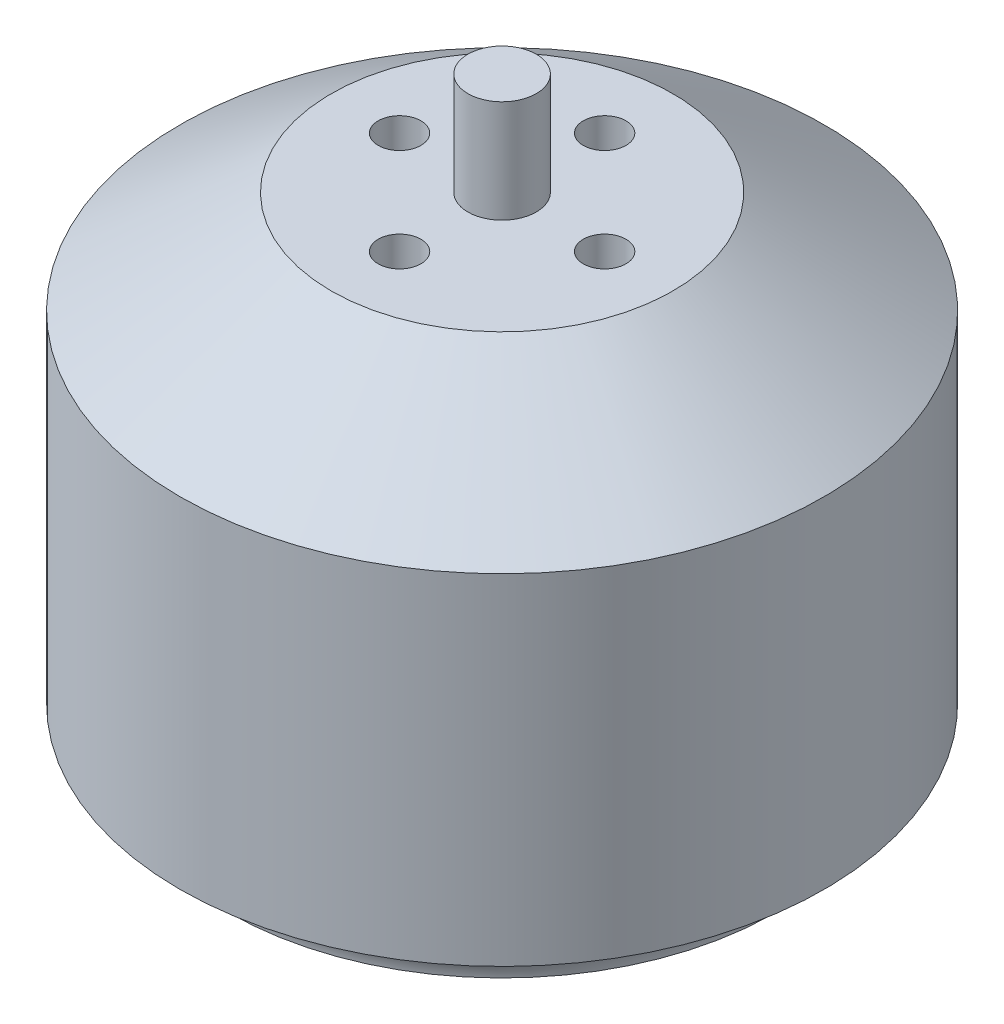
ISO-10303-21;
HEADER;
FILE_DESCRIPTION(('STEP AP214'),'2;1');
FILE_NAME('part.step','',(''),(''),'','','');
FILE_SCHEMA(('AUTOMOTIVE_DESIGN { 1 0 10303 214 1 1 1 1 }'));
ENDSEC;
DATA;
#1=APPLICATION_CONTEXT('core data for automotive mechanical design processes');
#2=APPLICATION_PROTOCOL_DEFINITION('international standard','automotive_design',2000,#1);
#3=PRODUCT_CONTEXT('',#1,'mechanical');
#4=PRODUCT('Part','Part','',(#3));
#5=PRODUCT_RELATED_PRODUCT_CATEGORY('part','',(#4));
#6=PRODUCT_DEFINITION_FORMATION('','',#4);
#7=PRODUCT_DEFINITION_CONTEXT('part definition',#1,'design');
#8=PRODUCT_DEFINITION('design','',#6,#7);
#9=PRODUCT_DEFINITION_SHAPE('','',#8);
#10=(LENGTH_UNIT() NAMED_UNIT(*) SI_UNIT(.MILLI.,.METRE.));
#11=(NAMED_UNIT(*) PLANE_ANGLE_UNIT() SI_UNIT($,.RADIAN.));
#12=(NAMED_UNIT(*) SI_UNIT($,.STERADIAN.) SOLID_ANGLE_UNIT());
#13=UNCERTAINTY_MEASURE_WITH_UNIT(LENGTH_MEASURE(1.E-05),#10,'distance_accuracy_value','');
#14=(GEOMETRIC_REPRESENTATION_CONTEXT(3) GLOBAL_UNCERTAINTY_ASSIGNED_CONTEXT((#13)) GLOBAL_UNIT_ASSIGNED_CONTEXT((#10,
#11,#12)) REPRESENTATION_CONTEXT('',''));
#15=CARTESIAN_POINT('',(0.,0.,0.));
#16=DIRECTION('',(0.,0.,1.));
#17=DIRECTION('',(1.,0.,0.));
#18=AXIS2_PLACEMENT_3D('',#15,#16,#17);
#19=CARTESIAN_POINT('',(0.,0.,0.));
#20=DIRECTION('',(0.,1.,0.));
#21=DIRECTION('',(0.,0.,1.));
#22=AXIS2_PLACEMENT_3D('',#19,#20,#21);
#23=PLANE('',#22);
#24=CARTESIAN_POINT('',(0.,0.,0.));
#25=DIRECTION('',(0.,1.,0.));
#26=DIRECTION('',(0.,0.,1.));
#27=AXIS2_PLACEMENT_3D('',#24,#25,#26);
#28=CIRCLE('',#27,16.);
#29=CARTESIAN_POINT('',(0.,0.,16.));
#30=VERTEX_POINT('',#29);
#31=EDGE_CURVE('E123',#30,#30,#28,.T.);
#32=ORIENTED_EDGE('',*,*,#31,.F.);
#33=EDGE_LOOP('',(#32));
#34=FACE_BOUND('',#33,.T.);
#35=CARTESIAN_POINT('',(0.,0.,9.5));
#36=DIRECTION('',(0.,-1.,0.));
#37=DIRECTION('',(0.,0.,-1.));
#38=AXIS2_PLACEMENT_3D('',#35,#36,#37);
#39=CIRCLE('',#38,1.24999999999999);
#40=CARTESIAN_POINT('',(0.,0.,8.25000000000001));
#41=VERTEX_POINT('',#40);
#42=EDGE_CURVE('E126',#41,#41,#39,.T.);
#43=ORIENTED_EDGE('',*,*,#42,.F.);
#44=EDGE_LOOP('',(#43));
#45=FACE_BOUND('',#44,.T.);
#46=CARTESIAN_POINT('',(12.5,0.,0.));
#47=DIRECTION('',(0.,-1.,0.));
#48=DIRECTION('',(0.,0.,-1.));
#49=AXIS2_PLACEMENT_3D('',#46,#47,#48);
#50=CIRCLE('',#49,1.24999999999999);
#51=CARTESIAN_POINT('',(12.5,0.,-1.24999999999999));
#52=VERTEX_POINT('',#51);
#53=EDGE_CURVE('E142',#52,#52,#50,.T.);
#54=ORIENTED_EDGE('',*,*,#53,.F.);
#55=EDGE_LOOP('',(#54));
#56=FACE_BOUND('',#55,.T.);
#57=CARTESIAN_POINT('',(0.,0.,-9.5));
#58=DIRECTION('',(0.,-1.,0.));
#59=DIRECTION('',(0.,0.,-1.));
#60=AXIS2_PLACEMENT_3D('',#57,#58,#59);
#61=CIRCLE('',#60,1.24999999999999);
#62=CARTESIAN_POINT('',(0.,0.,-10.75));
#63=VERTEX_POINT('',#62);
#64=EDGE_CURVE('E148',#63,#63,#61,.T.);
#65=ORIENTED_EDGE('',*,*,#64,.F.);
#66=EDGE_LOOP('',(#65));
#67=FACE_BOUND('',#66,.T.);
#68=CARTESIAN_POINT('',(-8.,0.,0.));
#69=DIRECTION('',(0.,-1.,0.));
#70=DIRECTION('',(0.,0.,-1.));
#71=AXIS2_PLACEMENT_3D('',#68,#69,#70);
#72=CIRCLE('',#71,1.24999999999999);
#73=CARTESIAN_POINT('',(-8.,0.,-1.24999999999999));
#74=VERTEX_POINT('',#73);
#75=EDGE_CURVE('E154',#74,#74,#72,.T.);
#76=ORIENTED_EDGE('',*,*,#75,.F.);
#77=EDGE_LOOP('',(#76));
#78=FACE_BOUND('',#77,.T.);
#79=CARTESIAN_POINT('',(-12.5,0.,0.));
#80=DIRECTION('',(0.,-1.,0.));
#81=DIRECTION('',(0.,0.,-1.));
#82=AXIS2_PLACEMENT_3D('',#79,#80,#81);
#83=CIRCLE('',#82,1.24999999999999);
#84=CARTESIAN_POINT('',(-12.5,0.,-1.24999999999999));
#85=VERTEX_POINT('',#84);
#86=EDGE_CURVE('E160',#85,#85,#83,.T.);
#87=ORIENTED_EDGE('',*,*,#86,.F.);
#88=EDGE_LOOP('',(#87));
#89=FACE_BOUND('',#88,.T.);
#90=CARTESIAN_POINT('',(0.,0.,0.));
#91=DIRECTION('',(0.,1.,0.));
#92=DIRECTION('',(0.,0.,1.));
#93=AXIS2_PLACEMENT_3D('',#90,#91,#92);
#94=CIRCLE('',#93,2.);
#95=CARTESIAN_POINT('',(0.,0.,2.));
#96=VERTEX_POINT('',#95);
#97=EDGE_CURVE('E11',#96,#96,#94,.F.);
#98=ORIENTED_EDGE('',*,*,#97,.F.);
#99=EDGE_LOOP('',(#98));
#100=FACE_BOUND('',#99,.T.);
#101=CARTESIAN_POINT('',(8.,0.,0.));
#102=DIRECTION('',(0.,-1.,0.));
#103=DIRECTION('',(0.,0.,-1.));
#104=AXIS2_PLACEMENT_3D('',#101,#102,#103);
#105=CIRCLE('',#104,1.24999999999999);
#106=CARTESIAN_POINT('',(8.,0.,-1.24999999999999));
#107=VERTEX_POINT('',#106);
#108=EDGE_CURVE('E136',#107,#107,#105,.T.);
#109=ORIENTED_EDGE('',*,*,#108,.F.);
#110=EDGE_LOOP('',(#109));
#111=FACE_BOUND('',#110,.T.);
#112=ADVANCED_FACE('F46',(#34,#45,#56,#67,#78,#89,#100,#111),#23,.F.);
#113=CARTESIAN_POINT('',(0.,-2.6,0.));
#114=DIRECTION('',(0.,1.,0.));
#115=DIRECTION('',(0.,0.,1.));
#116=AXIS2_PLACEMENT_3D('',#113,#114,#115);
#117=CYLINDRICAL_SURFACE('',#116,2.);
#118=CARTESIAN_POINT('',(0.,-2.6,0.));
#119=DIRECTION('',(0.,-1.,0.));
#120=DIRECTION('',(0.,0.,-1.));
#121=AXIS2_PLACEMENT_3D('',#118,#119,#120);
#122=CIRCLE('',#121,2.);
#123=CARTESIAN_POINT('',(0.,-2.6,-2.));
#124=VERTEX_POINT('',#123);
#125=EDGE_CURVE('E166',#124,#124,#122,.T.);
#126=ORIENTED_EDGE('',*,*,#125,.F.);
#127=EDGE_LOOP('',(#126));
#128=FACE_BOUND('',#127,.T.);
#129=ORIENTED_EDGE('',*,*,#97,.T.);
#130=EDGE_LOOP('',(#129));
#131=FACE_BOUND('',#130,.T.);
#132=ADVANCED_FACE('F204',(#128,#131),#117,.T.);
#133=CARTESIAN_POINT('',(0.,-2.6,0.));
#134=DIRECTION('',(0.,-1.,0.));
#135=DIRECTION('',(0.,0.,-1.));
#136=AXIS2_PLACEMENT_3D('',#133,#134,#135);
#137=PLANE('',#136);
#138=ORIENTED_EDGE('',*,*,#125,.T.);
#139=EDGE_LOOP('',(#138));
#140=FACE_BOUND('',#139,.T.);
#141=ADVANCED_FACE('F266',(#140),#137,.T.);
#142=CARTESIAN_POINT('',(-12.5,1.64892422621555,0.));
#143=DIRECTION('',(0.,-1.,0.));
#144=DIRECTION('',(0.,0.,-1.));
#145=AXIS2_PLACEMENT_3D('',#142,#143,#144);
#146=CONICAL_SURFACE('',#145,1.25,1.02974425867665);
#147=CARTESIAN_POINT('',(-12.5,2.4,0.));
#148=VERTEX_POINT('',#147);
#149=VERTEX_LOOP('',#148);
#150=FACE_BOUND('',#149,.T.);
#151=CARTESIAN_POINT('',(-12.5,1.64892422621555,0.));
#152=DIRECTION('',(0.,-1.,0.));
#153=DIRECTION('',(0.,0.,-1.));
#154=AXIS2_PLACEMENT_3D('',#151,#152,#153);
#155=CIRCLE('',#154,1.25);
#156=CARTESIAN_POINT('',(-12.5,1.64892422621555,-1.25));
#157=VERTEX_POINT('',#156);
#158=EDGE_CURVE('E163',#157,#157,#155,.T.);
#159=ORIENTED_EDGE('',*,*,#158,.T.);
#160=EDGE_LOOP('',(#159));
#161=FACE_BOUND('',#160,.T.);
#162=ADVANCED_FACE('F262',(#150,#161),#146,.F.);
#163=CARTESIAN_POINT('',(-12.5,0.,0.));
#164=DIRECTION('',(0.,-1.,0.));
#165=DIRECTION('',(0.,0.,-1.));
#166=AXIS2_PLACEMENT_3D('',#163,#164,#165);
#167=CYLINDRICAL_SURFACE('',#166,1.24999999999999);
#168=ORIENTED_EDGE('',*,*,#158,.F.);
#169=EDGE_LOOP('',(#168));
#170=FACE_BOUND('',#169,.T.);
#171=ORIENTED_EDGE('',*,*,#86,.T.);
#172=EDGE_LOOP('',(#171));
#173=FACE_BOUND('',#172,.T.);
#174=ADVANCED_FACE('F259',(#170,#173),#167,.F.);
#175=CARTESIAN_POINT('',(-8.,1.64892422621555,0.));
#176=DIRECTION('',(0.,-1.,0.));
#177=DIRECTION('',(0.,0.,-1.));
#178=AXIS2_PLACEMENT_3D('',#175,#176,#177);
#179=CONICAL_SURFACE('',#178,1.25,1.02974425867665);
#180=CARTESIAN_POINT('',(-8.,2.4,0.));
#181=VERTEX_POINT('',#180);
#182=VERTEX_LOOP('',#181);
#183=FACE_BOUND('',#182,.T.);
#184=CARTESIAN_POINT('',(-8.,1.64892422621555,0.));
#185=DIRECTION('',(0.,-1.,0.));
#186=DIRECTION('',(0.,0.,-1.));
#187=AXIS2_PLACEMENT_3D('',#184,#185,#186);
#188=CIRCLE('',#187,1.25);
#189=CARTESIAN_POINT('',(-8.,1.64892422621555,-1.25));
#190=VERTEX_POINT('',#189);
#191=EDGE_CURVE('E157',#190,#190,#188,.T.);
#192=ORIENTED_EDGE('',*,*,#191,.T.);
#193=EDGE_LOOP('',(#192));
#194=FACE_BOUND('',#193,.T.);
#195=ADVANCED_FACE('F255',(#183,#194),#179,.F.);
#196=CARTESIAN_POINT('',(-8.,0.,0.));
#197=DIRECTION('',(0.,-1.,0.));
#198=DIRECTION('',(0.,0.,-1.));
#199=AXIS2_PLACEMENT_3D('',#196,#197,#198);
#200=CYLINDRICAL_SURFACE('',#199,1.24999999999999);
#201=ORIENTED_EDGE('',*,*,#191,.F.);
#202=EDGE_LOOP('',(#201));
#203=FACE_BOUND('',#202,.T.);
#204=ORIENTED_EDGE('',*,*,#75,.T.);
#205=EDGE_LOOP('',(#204));
#206=FACE_BOUND('',#205,.T.);
#207=ADVANCED_FACE('F251',(#203,#206),#200,.F.);
#208=CARTESIAN_POINT('',(0.,1.64892422621555,-9.5));
#209=DIRECTION('',(0.,-1.,0.));
#210=DIRECTION('',(0.,0.,-1.));
#211=AXIS2_PLACEMENT_3D('',#208,#209,#210);
#212=CONICAL_SURFACE('',#211,1.25,1.02974425867665);
#213=CARTESIAN_POINT('',(0.,2.4,-9.5));
#214=VERTEX_POINT('',#213);
#215=VERTEX_LOOP('',#214);
#216=FACE_BOUND('',#215,.T.);
#217=CARTESIAN_POINT('',(0.,1.64892422621555,-9.5));
#218=DIRECTION('',(0.,-1.,0.));
#219=DIRECTION('',(0.,0.,-1.));
#220=AXIS2_PLACEMENT_3D('',#217,#218,#219);
#221=CIRCLE('',#220,1.25);
#222=CARTESIAN_POINT('',(0.,1.64892422621555,-10.75));
#223=VERTEX_POINT('',#222);
#224=EDGE_CURVE('E151',#223,#223,#221,.T.);
#225=ORIENTED_EDGE('',*,*,#224,.T.);
#226=EDGE_LOOP('',(#225));
#227=FACE_BOUND('',#226,.T.);
#228=ADVANCED_FACE('F247',(#216,#227),#212,.F.);
#229=CARTESIAN_POINT('',(0.,0.,-9.5));
#230=DIRECTION('',(0.,-1.,0.));
#231=DIRECTION('',(0.,0.,-1.));
#232=AXIS2_PLACEMENT_3D('',#229,#230,#231);
#233=CYLINDRICAL_SURFACE('',#232,1.24999999999999);
#234=ORIENTED_EDGE('',*,*,#224,.F.);
#235=EDGE_LOOP('',(#234));
#236=FACE_BOUND('',#235,.T.);
#237=ORIENTED_EDGE('',*,*,#64,.T.);
#238=EDGE_LOOP('',(#237));
#239=FACE_BOUND('',#238,.T.);
#240=ADVANCED_FACE('F243',(#236,#239),#233,.F.);
#241=CARTESIAN_POINT('',(12.5,1.64892422621555,0.));
#242=DIRECTION('',(0.,-1.,0.));
#243=DIRECTION('',(0.,0.,-1.));
#244=AXIS2_PLACEMENT_3D('',#241,#242,#243);
#245=CONICAL_SURFACE('',#244,1.25,1.02974425867665);
#246=CARTESIAN_POINT('',(12.5,2.4,0.));
#247=VERTEX_POINT('',#246);
#248=VERTEX_LOOP('',#247);
#249=FACE_BOUND('',#248,.T.);
#250=CARTESIAN_POINT('',(12.5,1.64892422621555,0.));
#251=DIRECTION('',(0.,-1.,0.));
#252=DIRECTION('',(0.,0.,-1.));
#253=AXIS2_PLACEMENT_3D('',#250,#251,#252);
#254=CIRCLE('',#253,1.25);
#255=CARTESIAN_POINT('',(12.5,1.64892422621555,-1.25));
#256=VERTEX_POINT('',#255);
#257=EDGE_CURVE('E145',#256,#256,#254,.T.);
#258=ORIENTED_EDGE('',*,*,#257,.T.);
#259=EDGE_LOOP('',(#258));
#260=FACE_BOUND('',#259,.T.);
#261=ADVANCED_FACE('F239',(#249,#260),#245,.F.);
#262=CARTESIAN_POINT('',(12.5,0.,0.));
#263=DIRECTION('',(0.,-1.,0.));
#264=DIRECTION('',(0.,0.,-1.));
#265=AXIS2_PLACEMENT_3D('',#262,#263,#264);
#266=CYLINDRICAL_SURFACE('',#265,1.24999999999999);
#267=ORIENTED_EDGE('',*,*,#257,.F.);
#268=EDGE_LOOP('',(#267));
#269=FACE_BOUND('',#268,.T.);
#270=ORIENTED_EDGE('',*,*,#53,.T.);
#271=EDGE_LOOP('',(#270));
#272=FACE_BOUND('',#271,.T.);
#273=ADVANCED_FACE('F231',(#269,#272),#266,.F.);
#274=CARTESIAN_POINT('',(8.,1.64892422621555,0.));
#275=DIRECTION('',(0.,-1.,0.));
#276=DIRECTION('',(0.,0.,-1.));
#277=AXIS2_PLACEMENT_3D('',#274,#275,#276);
#278=CONICAL_SURFACE('',#277,1.25,1.02974425867665);
#279=CARTESIAN_POINT('',(8.,2.4,0.));
#280=VERTEX_POINT('',#279);
#281=VERTEX_LOOP('',#280);
#282=FACE_BOUND('',#281,.T.);
#283=CARTESIAN_POINT('',(8.,1.64892422621555,0.));
#284=DIRECTION('',(0.,-1.,0.));
#285=DIRECTION('',(0.,0.,-1.));
#286=AXIS2_PLACEMENT_3D('',#283,#284,#285);
#287=CIRCLE('',#286,1.25);
#288=CARTESIAN_POINT('',(8.,1.64892422621555,-1.25));
#289=VERTEX_POINT('',#288);
#290=EDGE_CURVE('E139',#289,#289,#287,.T.);
#291=ORIENTED_EDGE('',*,*,#290,.T.);
#292=EDGE_LOOP('',(#291));
#293=FACE_BOUND('',#292,.T.);
#294=ADVANCED_FACE('F222',(#282,#293),#278,.F.);
#295=CARTESIAN_POINT('',(8.,0.,0.));
#296=DIRECTION('',(0.,-1.,0.));
#297=DIRECTION('',(0.,0.,-1.));
#298=AXIS2_PLACEMENT_3D('',#295,#296,#297);
#299=CYLINDRICAL_SURFACE('',#298,1.24999999999999);
#300=ORIENTED_EDGE('',*,*,#290,.F.);
#301=EDGE_LOOP('',(#300));
#302=FACE_BOUND('',#301,.T.);
#303=ORIENTED_EDGE('',*,*,#108,.T.);
#304=EDGE_LOOP('',(#303));
#305=FACE_BOUND('',#304,.T.);
#306=ADVANCED_FACE('F219',(#302,#305),#299,.F.);
#307=CARTESIAN_POINT('',(0.,1.64892422621555,9.5));
#308=DIRECTION('',(0.,-1.,0.));
#309=DIRECTION('',(0.,0.,-1.));
#310=AXIS2_PLACEMENT_3D('',#307,#308,#309);
#311=CONICAL_SURFACE('',#310,1.25,1.02974425867665);
#312=CARTESIAN_POINT('',(0.,2.4,9.5));
#313=VERTEX_POINT('',#312);
#314=VERTEX_LOOP('',#313);
#315=FACE_BOUND('',#314,.T.);
#316=CARTESIAN_POINT('',(0.,1.64892422621555,9.5));
#317=DIRECTION('',(0.,-1.,0.));
#318=DIRECTION('',(0.,0.,-1.));
#319=AXIS2_PLACEMENT_3D('',#316,#317,#318);
#320=CIRCLE('',#319,1.25);
#321=CARTESIAN_POINT('',(0.,1.64892422621555,8.25));
#322=VERTEX_POINT('',#321);
#323=EDGE_CURVE('E133',#322,#322,#320,.T.);
#324=ORIENTED_EDGE('',*,*,#323,.T.);
#325=EDGE_LOOP('',(#324));
#326=FACE_BOUND('',#325,.T.);
#327=ADVANCED_FACE('F221',(#315,#326),#311,.F.);
#328=CARTESIAN_POINT('',(0.,0.,9.5));
#329=DIRECTION('',(0.,-1.,0.));
#330=DIRECTION('',(0.,0.,-1.));
#331=AXIS2_PLACEMENT_3D('',#328,#329,#330);
#332=CYLINDRICAL_SURFACE('',#331,1.24999999999999);
#333=ORIENTED_EDGE('',*,*,#323,.F.);
#334=EDGE_LOOP('',(#333));
#335=FACE_BOUND('',#334,.T.);
#336=ORIENTED_EDGE('',*,*,#42,.T.);
#337=EDGE_LOOP('',(#336));
#338=FACE_BOUND('',#337,.T.);
#339=ADVANCED_FACE('F198',(#335,#338),#332,.F.);
#340=CARTESIAN_POINT('',(0.,-0.262019230769191,0.));
#341=DIRECTION('',(0.,1.,0.));
#342=DIRECTION('',(0.,0.,1.));
#343=AXIS2_PLACEMENT_3D('',#340,#341,#342);
#344=TOROIDAL_SURFACE('',#343,18.85,2.8620192307692);
#345=CARTESIAN_POINT('',(0.,2.60000000000002,0.));
#346=DIRECTION('',(0.,1.,0.));
#347=DIRECTION('',(0.,0.,1.));
#348=AXIS2_PLACEMENT_3D('',#345,#346,#347);
#349=CIRCLE('',#348,18.85);
#350=CARTESIAN_POINT('',(0.,2.60000000000002,18.85));
#351=VERTEX_POINT('',#350);
#352=EDGE_CURVE('E118',#351,#351,#349,.T.);
#353=ORIENTED_EDGE('',*,*,#352,.F.);
#354=EDGE_LOOP('',(#353));
#355=FACE_BOUND('',#354,.T.);
#356=ORIENTED_EDGE('',*,*,#31,.T.);
#357=EDGE_LOOP('',(#356));
#358=FACE_BOUND('',#357,.T.);
#359=ADVANCED_FACE('F193',(#355,#358),#344,.F.);
#360=CARTESIAN_POINT('',(0.,28.5,0.));
#361=DIRECTION('',(0.,-1.,0.));
#362=DIRECTION('',(0.,0.,-1.));
#363=AXIS2_PLACEMENT_3D('',#360,#361,#362);
#364=CYLINDRICAL_SURFACE('',#363,18.85);
#365=CARTESIAN_POINT('',(0.,22.5,0.));
#366=DIRECTION('',(0.,1.,0.));
#367=DIRECTION('',(0.,0.,1.));
#368=AXIS2_PLACEMENT_3D('',#365,#366,#367);
#369=CIRCLE('',#368,18.85);
#370=CARTESIAN_POINT('',(0.,22.5,18.85));
#371=VERTEX_POINT('',#370);
#372=EDGE_CURVE('E119',#371,#371,#369,.T.);
#373=ORIENTED_EDGE('',*,*,#372,.F.);
#374=EDGE_LOOP('',(#373));
#375=FACE_BOUND('',#374,.T.);
#376=ORIENTED_EDGE('',*,*,#352,.T.);
#377=EDGE_LOOP('',(#376));
#378=FACE_BOUND('',#377,.T.);
#379=ADVANCED_FACE('F48',(#375,#378),#364,.T.);
#380=CARTESIAN_POINT('',(0.,22.5,0.));
#381=DIRECTION('',(0.,-1.,0.));
#382=DIRECTION('',(0.,0.,-1.));
#383=AXIS2_PLACEMENT_3D('',#380,#381,#382);
#384=CONICAL_SURFACE('',#383,18.85,0.975011779171836);
#385=CARTESIAN_POINT('',(0.,28.5,0.));
#386=DIRECTION('',(0.,1.,0.));
#387=DIRECTION('',(0.,0.,1.));
#388=AXIS2_PLACEMENT_3D('',#385,#386,#387);
#389=CIRCLE('',#388,10.);
#390=CARTESIAN_POINT('',(0.,28.5,10.));
#391=VERTEX_POINT('',#390);
#392=EDGE_CURVE('E122',#391,#391,#389,.T.);
#393=ORIENTED_EDGE('',*,*,#392,.F.);
#394=EDGE_LOOP('',(#393));
#395=FACE_BOUND('',#394,.T.);
#396=ORIENTED_EDGE('',*,*,#372,.T.);
#397=EDGE_LOOP('',(#396));
#398=FACE_BOUND('',#397,.T.);
#399=ADVANCED_FACE('F184',(#395,#398),#384,.T.);
#400=CARTESIAN_POINT('',(0.,34.5,0.));
#401=DIRECTION('',(0.,1.,0.));
#402=DIRECTION('',(0.,0.,1.));
#403=AXIS2_PLACEMENT_3D('',#400,#401,#402);
#404=PLANE('',#403);
#405=CARTESIAN_POINT('',(0.,34.5,0.));
#406=DIRECTION('',(0.,1.,0.));
#407=DIRECTION('',(0.,0.,1.));
#408=AXIS2_PLACEMENT_3D('',#405,#406,#407);
#409=CIRCLE('',#408,2.);
#410=CARTESIAN_POINT('',(0.,34.5,2.));
#411=VERTEX_POINT('',#410);
#412=EDGE_CURVE('E54',#411,#411,#409,.T.);
#413=ORIENTED_EDGE('',*,*,#412,.T.);
#414=EDGE_LOOP('',(#413));
#415=FACE_BOUND('',#414,.T.);
#416=ADVANCED_FACE('F187',(#415),#404,.T.);
#417=CARTESIAN_POINT('',(0.,34.5,0.));
#418=DIRECTION('',(0.,-1.,0.));
#419=DIRECTION('',(0.,0.,-1.));
#420=AXIS2_PLACEMENT_3D('',#417,#418,#419);
#421=CYLINDRICAL_SURFACE('',#420,2.);
#422=ORIENTED_EDGE('',*,*,#412,.F.);
#423=EDGE_LOOP('',(#422));
#424=FACE_BOUND('',#423,.T.);
#425=CARTESIAN_POINT('',(0.,28.5,0.));
#426=DIRECTION('',(0.,1.,0.));
#427=DIRECTION('',(0.,0.,1.));
#428=AXIS2_PLACEMENT_3D('',#425,#426,#427);
#429=CIRCLE('',#428,2.);
#430=CARTESIAN_POINT('',(0.,28.5,2.));
#431=VERTEX_POINT('',#430);
#432=EDGE_CURVE('E169',#431,#431,#429,.T.);
#433=ORIENTED_EDGE('',*,*,#432,.T.);
#434=EDGE_LOOP('',(#433));
#435=FACE_BOUND('',#434,.T.);
#436=ADVANCED_FACE('F174',(#424,#435),#421,.T.);
#437=CARTESIAN_POINT('',(0.,28.5,0.));
#438=DIRECTION('',(0.,1.,0.));
#439=DIRECTION('',(0.,0.,1.));
#440=AXIS2_PLACEMENT_3D('',#437,#438,#439);
#441=PLANE('',#440);
#442=CARTESIAN_POINT('',(0.,28.5,-6.));
#443=DIRECTION('',(0.,1.,0.));
#444=DIRECTION('',(0.,0.,1.));
#445=AXIS2_PLACEMENT_3D('',#442,#443,#444);
#446=CIRCLE('',#445,1.24999999999999);
#447=CARTESIAN_POINT('',(0.,28.5,-4.75000000000001));
#448=VERTEX_POINT('',#447);
#449=EDGE_CURVE('E96',#448,#448,#446,.T.);
#450=ORIENTED_EDGE('',*,*,#449,.F.);
#451=EDGE_LOOP('',(#450));
#452=FACE_BOUND('',#451,.T.);
#453=CARTESIAN_POINT('',(6.,28.5,0.));
#454=DIRECTION('',(0.,1.,0.));
#455=DIRECTION('',(0.,0.,1.));
#456=AXIS2_PLACEMENT_3D('',#453,#454,#455);
#457=CIRCLE('',#456,1.24999999999999);
#458=CARTESIAN_POINT('',(6.,28.5,1.25000000000001));
#459=VERTEX_POINT('',#458);
#460=EDGE_CURVE('E95',#459,#459,#457,.T.);
#461=ORIENTED_EDGE('',*,*,#460,.F.);
#462=EDGE_LOOP('',(#461));
#463=FACE_BOUND('',#462,.T.);
#464=CARTESIAN_POINT('',(0.,28.5,5.99999999999994));
#465=DIRECTION('',(0.,1.,0.));
#466=DIRECTION('',(0.,0.,1.));
#467=AXIS2_PLACEMENT_3D('',#464,#465,#466);
#468=CIRCLE('',#467,1.24999999999999);
#469=CARTESIAN_POINT('',(0.,28.5,7.24999999999993));
#470=VERTEX_POINT('',#469);
#471=EDGE_CURVE('E106',#470,#470,#468,.T.);
#472=ORIENTED_EDGE('',*,*,#471,.F.);
#473=EDGE_LOOP('',(#472));
#474=FACE_BOUND('',#473,.T.);
#475=CARTESIAN_POINT('',(-6.,28.5,0.));
#476=DIRECTION('',(0.,1.,0.));
#477=DIRECTION('',(0.,0.,1.));
#478=AXIS2_PLACEMENT_3D('',#475,#476,#477);
#479=CIRCLE('',#478,1.24999999999999);
#480=CARTESIAN_POINT('',(-6.,28.5,1.24999999999993));
#481=VERTEX_POINT('',#480);
#482=EDGE_CURVE('E112',#481,#481,#479,.T.);
#483=ORIENTED_EDGE('',*,*,#482,.F.);
#484=EDGE_LOOP('',(#483));
#485=FACE_BOUND('',#484,.T.);
#486=ORIENTED_EDGE('',*,*,#432,.F.);
#487=EDGE_LOOP('',(#486));
#488=FACE_BOUND('',#487,.T.);
#489=ORIENTED_EDGE('',*,*,#392,.T.);
#490=EDGE_LOOP('',(#489));
#491=FACE_BOUND('',#490,.T.);
#492=ADVANCED_FACE('F176',(#452,#463,#474,#485,#488,#491),#441,.T.);
#493=CARTESIAN_POINT('',(-6.,23.2510757737845,0.));
#494=DIRECTION('',(0.,1.,0.));
#495=DIRECTION('',(0.,0.,1.));
#496=AXIS2_PLACEMENT_3D('',#493,#494,#495);
#497=CONICAL_SURFACE('',#496,1.25,1.02974425867665);
#498=CARTESIAN_POINT('',(-6.,22.5,0.));
#499=VERTEX_POINT('',#498);
#500=VERTEX_LOOP('',#499);
#501=FACE_BOUND('',#500,.T.);
#502=CARTESIAN_POINT('',(-6.,23.2510757737845,0.));
#503=DIRECTION('',(0.,1.,0.));
#504=DIRECTION('',(0.,0.,1.));
#505=AXIS2_PLACEMENT_3D('',#502,#503,#504);
#506=CIRCLE('',#505,1.25);
#507=CARTESIAN_POINT('',(-6.,23.2510757737845,1.24999999999994));
#508=VERTEX_POINT('',#507);
#509=EDGE_CURVE('E115',#508,#508,#506,.T.);
#510=ORIENTED_EDGE('',*,*,#509,.T.);
#511=EDGE_LOOP('',(#510));
#512=FACE_BOUND('',#511,.T.);
#513=ADVANCED_FACE('F179',(#501,#512),#497,.F.);
#514=CARTESIAN_POINT('',(-6.,28.5,0.));
#515=DIRECTION('',(0.,1.,0.));
#516=DIRECTION('',(0.,0.,1.));
#517=AXIS2_PLACEMENT_3D('',#514,#515,#516);
#518=CYLINDRICAL_SURFACE('',#517,1.24999999999999);
#519=ORIENTED_EDGE('',*,*,#509,.F.);
#520=EDGE_LOOP('',(#519));
#521=FACE_BOUND('',#520,.T.);
#522=ORIENTED_EDGE('',*,*,#482,.T.);
#523=EDGE_LOOP('',(#522));
#524=FACE_BOUND('',#523,.T.);
#525=ADVANCED_FACE('F294',(#521,#524),#518,.F.);
#526=CARTESIAN_POINT('',(0.,23.2510757737845,5.99999999999994));
#527=DIRECTION('',(0.,1.,0.));
#528=DIRECTION('',(0.,0.,1.));
#529=AXIS2_PLACEMENT_3D('',#526,#527,#528);
#530=CONICAL_SURFACE('',#529,1.25,1.02974425867665);
#531=CARTESIAN_POINT('',(0.,22.5,5.99999999999994));
#532=VERTEX_POINT('',#531);
#533=VERTEX_LOOP('',#532);
#534=FACE_BOUND('',#533,.T.);
#535=CARTESIAN_POINT('',(0.,23.2510757737845,5.99999999999994));
#536=DIRECTION('',(0.,1.,0.));
#537=DIRECTION('',(0.,0.,1.));
#538=AXIS2_PLACEMENT_3D('',#535,#536,#537);
#539=CIRCLE('',#538,1.25);
#540=CARTESIAN_POINT('',(0.,23.2510757737845,7.24999999999994));
#541=VERTEX_POINT('',#540);
#542=EDGE_CURVE('E109',#541,#541,#539,.T.);
#543=ORIENTED_EDGE('',*,*,#542,.T.);
#544=EDGE_LOOP('',(#543));
#545=FACE_BOUND('',#544,.T.);
#546=ADVANCED_FACE('F304',(#534,#545),#530,.F.);
#547=CARTESIAN_POINT('',(0.,28.5,5.99999999999994));
#548=DIRECTION('',(0.,1.,0.));
#549=DIRECTION('',(0.,0.,1.));
#550=AXIS2_PLACEMENT_3D('',#547,#548,#549);
#551=CYLINDRICAL_SURFACE('',#550,1.24999999999999);
#552=ORIENTED_EDGE('',*,*,#542,.F.);
#553=EDGE_LOOP('',(#552));
#554=FACE_BOUND('',#553,.T.);
#555=ORIENTED_EDGE('',*,*,#471,.T.);
#556=EDGE_LOOP('',(#555));
#557=FACE_BOUND('',#556,.T.);
#558=ADVANCED_FACE('F314',(#554,#557),#551,.F.);
#559=CARTESIAN_POINT('',(6.,23.2510757737845,0.));
#560=DIRECTION('',(0.,1.,0.));
#561=DIRECTION('',(0.,0.,1.));
#562=AXIS2_PLACEMENT_3D('',#559,#560,#561);
#563=CONICAL_SURFACE('',#562,1.25,1.02974425867665);
#564=CARTESIAN_POINT('',(6.,22.5,0.));
#565=VERTEX_POINT('',#564);
#566=VERTEX_LOOP('',#565);
#567=FACE_BOUND('',#566,.T.);
#568=CARTESIAN_POINT('',(6.,23.2510757737845,0.));
#569=DIRECTION('',(0.,1.,0.));
#570=DIRECTION('',(0.,0.,1.));
#571=AXIS2_PLACEMENT_3D('',#568,#569,#570);
#572=CIRCLE('',#571,1.25);
#573=CARTESIAN_POINT('',(6.,23.2510757737845,1.25000000000002));
#574=VERTEX_POINT('',#573);
#575=EDGE_CURVE('E99',#574,#574,#572,.T.);
#576=ORIENTED_EDGE('',*,*,#575,.T.);
#577=EDGE_LOOP('',(#576));
#578=FACE_BOUND('',#577,.T.);
#579=ADVANCED_FACE('F323',(#567,#578),#563,.F.);
#580=CARTESIAN_POINT('',(6.,28.5,0.));
#581=DIRECTION('',(0.,1.,0.));
#582=DIRECTION('',(0.,0.,1.));
#583=AXIS2_PLACEMENT_3D('',#580,#581,#582);
#584=CYLINDRICAL_SURFACE('',#583,1.24999999999999);
#585=ORIENTED_EDGE('',*,*,#575,.F.);
#586=EDGE_LOOP('',(#585));
#587=FACE_BOUND('',#586,.T.);
#588=ORIENTED_EDGE('',*,*,#460,.T.);
#589=EDGE_LOOP('',(#588));
#590=FACE_BOUND('',#589,.T.);
#591=ADVANCED_FACE('F89',(#587,#590),#584,.F.);
#592=CARTESIAN_POINT('',(0.,23.2510757737845,-6.));
#593=DIRECTION('',(0.,1.,0.));
#594=DIRECTION('',(0.,0.,1.));
#595=AXIS2_PLACEMENT_3D('',#592,#593,#594);
#596=CONICAL_SURFACE('',#595,1.25,1.02974425867665);
#597=CARTESIAN_POINT('',(0.,22.5,-6.));
#598=VERTEX_POINT('',#597);
#599=VERTEX_LOOP('',#598);
#600=FACE_BOUND('',#599,.T.);
#601=CARTESIAN_POINT('',(0.,23.2510757737845,-6.));
#602=DIRECTION('',(0.,1.,0.));
#603=DIRECTION('',(0.,0.,1.));
#604=AXIS2_PLACEMENT_3D('',#601,#602,#603);
#605=CIRCLE('',#604,1.25);
#606=CARTESIAN_POINT('',(0.,23.2510757737845,-4.75));
#607=VERTEX_POINT('',#606);
#608=EDGE_CURVE('E93',#607,#607,#605,.T.);
#609=ORIENTED_EDGE('',*,*,#608,.T.);
#610=EDGE_LOOP('',(#609));
#611=FACE_BOUND('',#610,.T.);
#612=ADVANCED_FACE('F85',(#600,#611),#596,.F.);
#613=CARTESIAN_POINT('',(0.,28.5,-6.));
#614=DIRECTION('',(0.,1.,0.));
#615=DIRECTION('',(0.,0.,1.));
#616=AXIS2_PLACEMENT_3D('',#613,#614,#615);
#617=CYLINDRICAL_SURFACE('',#616,1.24999999999999);
#618=ORIENTED_EDGE('',*,*,#608,.F.);
#619=EDGE_LOOP('',(#618));
#620=FACE_BOUND('',#619,.T.);
#621=ORIENTED_EDGE('',*,*,#449,.T.);
#622=EDGE_LOOP('',(#621));
#623=FACE_BOUND('',#622,.T.);
#624=ADVANCED_FACE('F88',(#620,#623),#617,.F.);
#625=CLOSED_SHELL('',(#112,#132,#141,#162,#174,#195,#207,#228,#240,#261,#273,#294,#306,#327,
#339,#359,#379,#399,#416,#436,#492,#513,#525,#546,#558,#579,#591,#612,#624));
#626=MANIFOLD_SOLID_BREP('B2',#625);
#627=ADVANCED_BREP_SHAPE_REPRESENTATION('',(#18,#626),#14);
#628=SHAPE_DEFINITION_REPRESENTATION(#9,#627);
ENDSEC;
END-ISO-10303-21;
